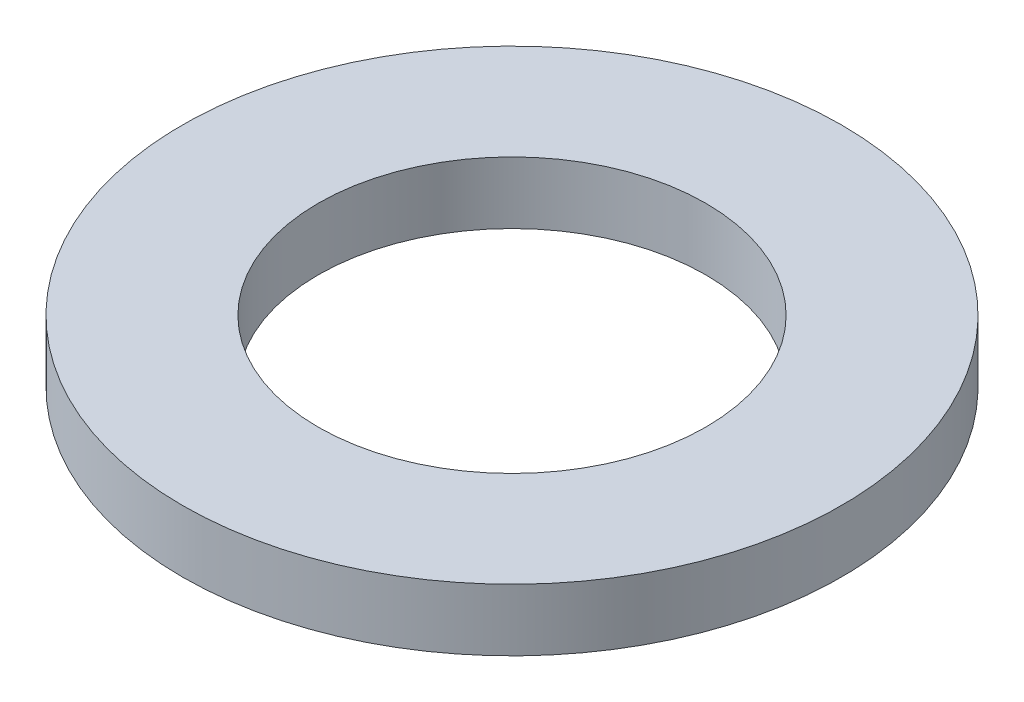
ISO-10303-21;
HEADER;
FILE_DESCRIPTION(('STEP AP214'),'2;1');
FILE_NAME('part.step','',(''),(''),'','','');
FILE_SCHEMA(('AUTOMOTIVE_DESIGN { 1 0 10303 214 1 1 1 1 }'));
ENDSEC;
DATA;
#1=APPLICATION_CONTEXT('core data for automotive mechanical design processes');
#2=APPLICATION_PROTOCOL_DEFINITION('international standard','automotive_design',2000,#1);
#3=PRODUCT_CONTEXT('',#1,'mechanical');
#4=PRODUCT('Part','Part','',(#3));
#5=PRODUCT_RELATED_PRODUCT_CATEGORY('part','',(#4));
#6=PRODUCT_DEFINITION_FORMATION('','',#4);
#7=PRODUCT_DEFINITION_CONTEXT('part definition',#1,'design');
#8=PRODUCT_DEFINITION('design','',#6,#7);
#9=PRODUCT_DEFINITION_SHAPE('','',#8);
#10=(LENGTH_UNIT() NAMED_UNIT(*) SI_UNIT(.MILLI.,.METRE.));
#11=(NAMED_UNIT(*) PLANE_ANGLE_UNIT() SI_UNIT($,.RADIAN.));
#12=(NAMED_UNIT(*) SI_UNIT($,.STERADIAN.) SOLID_ANGLE_UNIT());
#13=UNCERTAINTY_MEASURE_WITH_UNIT(LENGTH_MEASURE(1.E-05),#10,'distance_accuracy_value','');
#14=(GEOMETRIC_REPRESENTATION_CONTEXT(3) GLOBAL_UNCERTAINTY_ASSIGNED_CONTEXT((#13)) GLOBAL_UNIT_ASSIGNED_CONTEXT((#10,
#11,#12)) REPRESENTATION_CONTEXT('',''));
#15=CARTESIAN_POINT('',(0.,0.,0.));
#16=DIRECTION('',(0.,0.,1.));
#17=DIRECTION('',(1.,0.,0.));
#18=AXIS2_PLACEMENT_3D('',#15,#16,#17);
#19=CARTESIAN_POINT('',(0.,8.,0.));
#20=DIRECTION('',(0.,-1.,0.));
#21=DIRECTION('',(0.,0.,-1.));
#22=AXIS2_PLACEMENT_3D('',#19,#20,#21);
#23=CYLINDRICAL_SURFACE('',#22,42.5);
#24=CARTESIAN_POINT('',(0.,8.,0.));
#25=DIRECTION('',(0.,1.,0.));
#26=DIRECTION('',(0.,0.,1.));
#27=AXIS2_PLACEMENT_3D('',#24,#25,#26);
#28=CIRCLE('',#27,42.5);
#29=CARTESIAN_POINT('',(0.,8.,42.5));
#30=VERTEX_POINT('',#29);
#31=EDGE_CURVE('E10',#30,#30,#28,.T.);
#32=ORIENTED_EDGE('',*,*,#31,.F.);
#33=EDGE_LOOP('',(#32));
#34=FACE_BOUND('',#33,.T.);
#35=CARTESIAN_POINT('',(0.,0.,0.));
#36=DIRECTION('',(0.,1.,0.));
#37=DIRECTION('',(0.,0.,1.));
#38=AXIS2_PLACEMENT_3D('',#35,#36,#37);
#39=CIRCLE('',#38,42.5);
#40=CARTESIAN_POINT('',(0.,0.,42.5));
#41=VERTEX_POINT('',#40);
#42=EDGE_CURVE('E37',#41,#41,#39,.T.);
#43=ORIENTED_EDGE('',*,*,#42,.T.);
#44=EDGE_LOOP('',(#43));
#45=FACE_BOUND('',#44,.T.);
#46=ADVANCED_FACE('F40',(#34,#45),#23,.T.);
#47=CARTESIAN_POINT('',(0.,8.,0.));
#48=DIRECTION('',(0.,1.,0.));
#49=DIRECTION('',(0.,0.,1.));
#50=AXIS2_PLACEMENT_3D('',#47,#48,#49);
#51=PLANE('',#50);
#52=CARTESIAN_POINT('',(0.,8.,0.));
#53=DIRECTION('',(0.,1.,0.));
#54=DIRECTION('',(0.,0.,1.));
#55=AXIS2_PLACEMENT_3D('',#52,#53,#54);
#56=CIRCLE('',#55,25.);
#57=CARTESIAN_POINT('',(0.,8.,25.));
#58=VERTEX_POINT('',#57);
#59=EDGE_CURVE('E50',#58,#58,#56,.T.);
#60=ORIENTED_EDGE('',*,*,#59,.F.);
#61=EDGE_LOOP('',(#60));
#62=FACE_BOUND('',#61,.T.);
#63=ORIENTED_EDGE('',*,*,#31,.T.);
#64=EDGE_LOOP('',(#63));
#65=FACE_BOUND('',#64,.T.);
#66=ADVANCED_FACE('F59',(#62,#65),#51,.T.);
#67=CARTESIAN_POINT('',(0.,0.,0.));
#68=DIRECTION('',(0.,1.,0.));
#69=DIRECTION('',(0.,0.,1.));
#70=AXIS2_PLACEMENT_3D('',#67,#68,#69);
#71=PLANE('',#70);
#72=CARTESIAN_POINT('',(0.,0.,0.));
#73=DIRECTION('',(0.,1.,0.));
#74=DIRECTION('',(0.,0.,1.));
#75=AXIS2_PLACEMENT_3D('',#72,#73,#74);
#76=CIRCLE('',#75,25.);
#77=CARTESIAN_POINT('',(0.,0.,25.));
#78=VERTEX_POINT('',#77);
#79=EDGE_CURVE('E47',#78,#78,#76,.T.);
#80=ORIENTED_EDGE('',*,*,#79,.T.);
#81=EDGE_LOOP('',(#80));
#82=FACE_BOUND('',#81,.T.);
#83=ORIENTED_EDGE('',*,*,#42,.F.);
#84=EDGE_LOOP('',(#83));
#85=FACE_BOUND('',#84,.T.);
#86=ADVANCED_FACE('F58',(#82,#85),#71,.F.);
#87=CARTESIAN_POINT('',(0.,8.,0.));
#88=DIRECTION('',(0.,-1.,0.));
#89=DIRECTION('',(0.,0.,-1.));
#90=AXIS2_PLACEMENT_3D('',#87,#88,#89);
#91=CYLINDRICAL_SURFACE('',#90,25.);
#92=ORIENTED_EDGE('',*,*,#59,.T.);
#93=EDGE_LOOP('',(#92));
#94=FACE_BOUND('',#93,.T.);
#95=ORIENTED_EDGE('',*,*,#79,.F.);
#96=EDGE_LOOP('',(#95));
#97=FACE_BOUND('',#96,.T.);
#98=ADVANCED_FACE('F54',(#94,#97),#91,.F.);
#99=CLOSED_SHELL('',(#46,#66,#86,#98));
#100=MANIFOLD_SOLID_BREP('B2',#99);
#101=ADVANCED_BREP_SHAPE_REPRESENTATION('',(#18,#100),#14);
#102=SHAPE_DEFINITION_REPRESENTATION(#9,#101);
ENDSEC;
END-ISO-10303-21;
